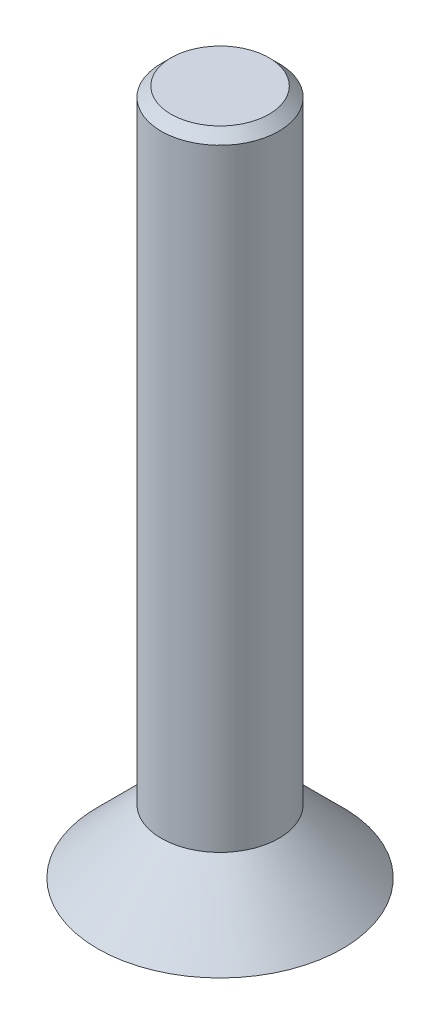
ISO-10303-21;
HEADER;
FILE_DESCRIPTION(('STEP AP214'),'2;1');
FILE_NAME('part.step','',(''),(''),'','','');
FILE_SCHEMA(('AUTOMOTIVE_DESIGN { 1 0 10303 214 1 1 1 1 }'));
ENDSEC;
DATA;
#1=APPLICATION_CONTEXT('core data for automotive mechanical design processes');
#2=APPLICATION_PROTOCOL_DEFINITION('international standard','automotive_design',2000,#1);
#3=PRODUCT_CONTEXT('',#1,'mechanical');
#4=PRODUCT('Part','Part','',(#3));
#5=PRODUCT_RELATED_PRODUCT_CATEGORY('part','',(#4));
#6=PRODUCT_DEFINITION_FORMATION('','',#4);
#7=PRODUCT_DEFINITION_CONTEXT('part definition',#1,'design');
#8=PRODUCT_DEFINITION('design','',#6,#7);
#9=PRODUCT_DEFINITION_SHAPE('','',#8);
#10=(LENGTH_UNIT() NAMED_UNIT(*) SI_UNIT(.MILLI.,.METRE.));
#11=(NAMED_UNIT(*) PLANE_ANGLE_UNIT() SI_UNIT($,.RADIAN.));
#12=(NAMED_UNIT(*) SI_UNIT($,.STERADIAN.) SOLID_ANGLE_UNIT());
#13=UNCERTAINTY_MEASURE_WITH_UNIT(LENGTH_MEASURE(1.E-05),#10,'distance_accuracy_value','');
#14=(GEOMETRIC_REPRESENTATION_CONTEXT(3) GLOBAL_UNCERTAINTY_ASSIGNED_CONTEXT((#13)) GLOBAL_UNIT_ASSIGNED_CONTEXT((#10,
#11,#12)) REPRESENTATION_CONTEXT('',''));
#15=CARTESIAN_POINT('',(0.,0.,0.));
#16=DIRECTION('',(0.,0.,1.));
#17=DIRECTION('',(1.,0.,0.));
#18=AXIS2_PLACEMENT_3D('',#15,#16,#17);
#19=CARTESIAN_POINT('',(0.,0.,0.));
#20=DIRECTION('',(0.,1.,0.));
#21=DIRECTION('',(0.,0.,1.));
#22=AXIS2_PLACEMENT_3D('',#19,#20,#21);
#23=PLANE('',#22);
#24=CARTESIAN_POINT('',(0.,0.,0.));
#25=DIRECTION('',(0.,1.,0.));
#26=DIRECTION('',(0.,0.,1.));
#27=AXIS2_PLACEMENT_3D('',#24,#25,#26);
#28=CIRCLE('',#27,2.5);
#29=CARTESIAN_POINT('',(0.,0.,2.5));
#30=VERTEX_POINT('',#29);
#31=EDGE_CURVE('E128',#30,#30,#28,.T.);
#32=ORIENTED_EDGE('',*,*,#31,.F.);
#33=EDGE_LOOP('',(#32));
#34=FACE_BOUND('',#33,.T.);
#35=DIRECTION('',(0.866025403784439,0.,0.5));
#36=VECTOR('',#35,1.);
#37=CARTESIAN_POINT('',(-0.75,0.,0.433012701892219));
#38=LINE('',#37,#36);
#39=CARTESIAN_POINT('',(-0.75,0.,0.433012701892219));
#40=VERTEX_POINT('',#39);
#41=CARTESIAN_POINT('',(0.,0.,0.866025403784438));
#42=VERTEX_POINT('',#41);
#43=EDGE_CURVE('E57',#40,#42,#38,.T.);
#44=ORIENTED_EDGE('',*,*,#43,.T.);
#45=DIRECTION('',(0.866025403784439,0.,-0.5));
#46=VECTOR('',#45,1.);
#47=CARTESIAN_POINT('',(0.,0.,0.866025403784438));
#48=LINE('',#47,#46);
#49=CARTESIAN_POINT('',(0.75,0.,0.43301270189222));
#50=VERTEX_POINT('',#49);
#51=EDGE_CURVE('E113',#42,#50,#48,.T.);
#52=ORIENTED_EDGE('',*,*,#51,.T.);
#53=DIRECTION('',(0.,0.,-1.));
#54=VECTOR('',#53,1.);
#55=CARTESIAN_POINT('',(0.75,0.,0.43301270189222));
#56=LINE('',#55,#54);
#57=CARTESIAN_POINT('',(0.75,0.,-0.43301270189222));
#58=VERTEX_POINT('',#57);
#59=EDGE_CURVE('E111',#50,#58,#56,.T.);
#60=ORIENTED_EDGE('',*,*,#59,.T.);
#61=DIRECTION('',(-0.866025403784439,0.,-0.5));
#62=VECTOR('',#61,1.);
#63=CARTESIAN_POINT('',(0.75,0.,-0.43301270189222));
#64=LINE('',#63,#62);
#65=CARTESIAN_POINT('',(0.,0.,-0.866025403784439));
#66=VERTEX_POINT('',#65);
#67=EDGE_CURVE('E92',#58,#66,#64,.T.);
#68=ORIENTED_EDGE('',*,*,#67,.T.);
#69=DIRECTION('',(-0.866025403784439,0.,0.5));
#70=VECTOR('',#69,1.);
#71=CARTESIAN_POINT('',(0.,0.,-0.866025403784439));
#72=LINE('',#71,#70);
#73=CARTESIAN_POINT('',(-0.75,0.,-0.43301270189222));
#74=VERTEX_POINT('',#73);
#75=EDGE_CURVE('E101',#66,#74,#72,.T.);
#76=ORIENTED_EDGE('',*,*,#75,.T.);
#77=DIRECTION('',(0.,0.,1.));
#78=VECTOR('',#77,1.);
#79=CARTESIAN_POINT('',(-0.75,0.,-0.43301270189222));
#80=LINE('',#79,#78);
#81=EDGE_CURVE('E107',#74,#40,#80,.T.);
#82=ORIENTED_EDGE('',*,*,#81,.T.);
#83=EDGE_LOOP('',(#44,#52,#60,#68,#76,#82));
#84=FACE_BOUND('',#83,.T.);
#85=ADVANCED_FACE('F41',(#34,#84),#23,.F.);
#86=CARTESIAN_POINT('',(-0.75,1.3,0.433012701892219));
#87=DIRECTION('',(0.5,0.,-0.866025403784439));
#88=DIRECTION('',(-0.866025403784439,0.,-0.5));
#89=AXIS2_PLACEMENT_3D('',#86,#87,#88);
#90=PLANE('',#89);
#91=ORIENTED_EDGE('',*,*,#43,.F.);
#92=DIRECTION('',(0.,-1.,0.));
#93=VECTOR('',#92,1.);
#94=CARTESIAN_POINT('',(-0.75,1.3,0.433012701892219));
#95=LINE('',#94,#93);
#96=CARTESIAN_POINT('',(-0.75,1.3,0.433012701892219));
#97=VERTEX_POINT('',#96);
#98=EDGE_CURVE('E119',#97,#40,#95,.T.);
#99=ORIENTED_EDGE('',*,*,#98,.F.);
#100=DIRECTION('',(0.866025403784439,0.,0.5));
#101=VECTOR('',#100,1.);
#102=CARTESIAN_POINT('',(-0.75,1.3,0.433012701892219));
#103=LINE('',#102,#101);
#104=CARTESIAN_POINT('',(0.,1.3,0.866025403784438));
#105=VERTEX_POINT('',#104);
#106=EDGE_CURVE('E118',#97,#105,#103,.T.);
#107=ORIENTED_EDGE('',*,*,#106,.T.);
#108=DIRECTION('',(0.,-1.,0.));
#109=VECTOR('',#108,1.);
#110=CARTESIAN_POINT('',(0.,1.3,0.866025403784438));
#111=LINE('',#110,#109);
#112=EDGE_CURVE('E126',#105,#42,#111,.T.);
#113=ORIENTED_EDGE('',*,*,#112,.T.);
#114=EDGE_LOOP('',(#91,#99,#107,#113));
#115=FACE_BOUND('',#114,.T.);
#116=ADVANCED_FACE('F147',(#115),#90,.T.);
#117=CARTESIAN_POINT('',(0.,1.3,0.866025403784438));
#118=DIRECTION('',(-0.5,0.,-0.866025403784439));
#119=DIRECTION('',(-0.866025403784439,0.,0.5));
#120=AXIS2_PLACEMENT_3D('',#117,#118,#119);
#121=PLANE('',#120);
#122=ORIENTED_EDGE('',*,*,#51,.F.);
#123=ORIENTED_EDGE('',*,*,#112,.F.);
#124=DIRECTION('',(0.866025403784439,0.,-0.5));
#125=VECTOR('',#124,1.);
#126=CARTESIAN_POINT('',(0.,1.3,0.866025403784438));
#127=LINE('',#126,#125);
#128=CARTESIAN_POINT('',(0.75,1.3,0.43301270189222));
#129=VERTEX_POINT('',#128);
#130=EDGE_CURVE('E206',#105,#129,#127,.T.);
#131=ORIENTED_EDGE('',*,*,#130,.T.);
#132=DIRECTION('',(0.,-1.,0.));
#133=VECTOR('',#132,1.);
#134=CARTESIAN_POINT('',(0.75,1.3,0.43301270189222));
#135=LINE('',#134,#133);
#136=EDGE_CURVE('E124',#129,#50,#135,.T.);
#137=ORIENTED_EDGE('',*,*,#136,.T.);
#138=EDGE_LOOP('',(#122,#123,#131,#137));
#139=FACE_BOUND('',#138,.T.);
#140=ADVANCED_FACE('F153',(#139),#121,.T.);
#141=CARTESIAN_POINT('',(0.75,1.3,0.43301270189222));
#142=DIRECTION('',(-1.,0.,0.));
#143=DIRECTION('',(0.,0.,1.));
#144=AXIS2_PLACEMENT_3D('',#141,#142,#143);
#145=PLANE('',#144);
#146=ORIENTED_EDGE('',*,*,#59,.F.);
#147=ORIENTED_EDGE('',*,*,#136,.F.);
#148=DIRECTION('',(0.,0.,-1.));
#149=VECTOR('',#148,1.);
#150=CARTESIAN_POINT('',(0.75,1.3,0.43301270189222));
#151=LINE('',#150,#149);
#152=CARTESIAN_POINT('',(0.75,1.3,-0.43301270189222));
#153=VERTEX_POINT('',#152);
#154=EDGE_CURVE('E204',#129,#153,#151,.T.);
#155=ORIENTED_EDGE('',*,*,#154,.T.);
#156=DIRECTION('',(0.,-1.,0.));
#157=VECTOR('',#156,1.);
#158=CARTESIAN_POINT('',(0.75,1.3,-0.43301270189222));
#159=LINE('',#158,#157);
#160=EDGE_CURVE('E97',#153,#58,#159,.T.);
#161=ORIENTED_EDGE('',*,*,#160,.T.);
#162=EDGE_LOOP('',(#146,#147,#155,#161));
#163=FACE_BOUND('',#162,.T.);
#164=ADVANCED_FACE('F185',(#163),#145,.T.);
#165=CARTESIAN_POINT('',(0.75,1.3,-0.43301270189222));
#166=DIRECTION('',(-0.5,0.,0.866025403784439));
#167=DIRECTION('',(0.866025403784439,0.,0.5));
#168=AXIS2_PLACEMENT_3D('',#165,#166,#167);
#169=PLANE('',#168);
#170=ORIENTED_EDGE('',*,*,#67,.F.);
#171=ORIENTED_EDGE('',*,*,#160,.F.);
#172=DIRECTION('',(-0.866025403784439,0.,-0.5));
#173=VECTOR('',#172,1.);
#174=CARTESIAN_POINT('',(0.75,1.3,-0.43301270189222));
#175=LINE('',#174,#173);
#176=CARTESIAN_POINT('',(0.,1.3,-0.866025403784439));
#177=VERTEX_POINT('',#176);
#178=EDGE_CURVE('E66',#153,#177,#175,.T.);
#179=ORIENTED_EDGE('',*,*,#178,.T.);
#180=DIRECTION('',(0.,-1.,0.));
#181=VECTOR('',#180,1.);
#182=CARTESIAN_POINT('',(0.,1.3,-0.866025403784439));
#183=LINE('',#182,#181);
#184=EDGE_CURVE('E87',#177,#66,#183,.T.);
#185=ORIENTED_EDGE('',*,*,#184,.T.);
#186=EDGE_LOOP('',(#170,#171,#179,#185));
#187=FACE_BOUND('',#186,.T.);
#188=ADVANCED_FACE('F89',(#187),#169,.T.);
#189=CARTESIAN_POINT('',(0.,1.3,-0.866025403784439));
#190=DIRECTION('',(0.5,0.,0.866025403784439));
#191=DIRECTION('',(0.866025403784439,0.,-0.5));
#192=AXIS2_PLACEMENT_3D('',#189,#190,#191);
#193=PLANE('',#192);
#194=ORIENTED_EDGE('',*,*,#75,.F.);
#195=ORIENTED_EDGE('',*,*,#184,.F.);
#196=DIRECTION('',(-0.866025403784439,0.,0.5));
#197=VECTOR('',#196,1.);
#198=CARTESIAN_POINT('',(0.,1.3,-0.866025403784439));
#199=LINE('',#198,#197);
#200=CARTESIAN_POINT('',(-0.75,1.3,-0.43301270189222));
#201=VERTEX_POINT('',#200);
#202=EDGE_CURVE('E201',#177,#201,#199,.T.);
#203=ORIENTED_EDGE('',*,*,#202,.T.);
#204=DIRECTION('',(0.,-1.,0.));
#205=VECTOR('',#204,1.);
#206=CARTESIAN_POINT('',(-0.75,1.3,-0.43301270189222));
#207=LINE('',#206,#205);
#208=EDGE_CURVE('E98',#201,#74,#207,.T.);
#209=ORIENTED_EDGE('',*,*,#208,.T.);
#210=EDGE_LOOP('',(#194,#195,#203,#209));
#211=FACE_BOUND('',#210,.T.);
#212=ADVANCED_FACE('F102',(#211),#193,.T.);
#213=CARTESIAN_POINT('',(-0.75,1.3,-0.43301270189222));
#214=DIRECTION('',(1.,0.,0.));
#215=DIRECTION('',(0.,0.,-1.));
#216=AXIS2_PLACEMENT_3D('',#213,#214,#215);
#217=PLANE('',#216);
#218=ORIENTED_EDGE('',*,*,#81,.F.);
#219=ORIENTED_EDGE('',*,*,#208,.F.);
#220=DIRECTION('',(0.,0.,1.));
#221=VECTOR('',#220,1.);
#222=CARTESIAN_POINT('',(-0.75,1.3,-0.43301270189222));
#223=LINE('',#222,#221);
#224=EDGE_CURVE('E121',#201,#97,#223,.T.);
#225=ORIENTED_EDGE('',*,*,#224,.T.);
#226=ORIENTED_EDGE('',*,*,#98,.T.);
#227=EDGE_LOOP('',(#218,#219,#225,#226));
#228=FACE_BOUND('',#227,.T.);
#229=ADVANCED_FACE('F163',(#228),#217,.T.);
#230=CARTESIAN_POINT('',(0.,1.3,0.));
#231=DIRECTION('',(0.,-1.,0.));
#232=DIRECTION('',(0.,0.,-1.));
#233=AXIS2_PLACEMENT_3D('',#230,#231,#232);
#234=CONICAL_SURFACE('',#233,1.2,0.785398163397446);
#235=ORIENTED_EDGE('',*,*,#31,.T.);
#236=EDGE_LOOP('',(#235));
#237=FACE_BOUND('',#236,.T.);
#238=CARTESIAN_POINT('',(0.,1.3,0.));
#239=DIRECTION('',(0.,1.,0.));
#240=DIRECTION('',(0.,0.,1.));
#241=AXIS2_PLACEMENT_3D('',#238,#239,#240);
#242=CIRCLE('',#241,1.2);
#243=CARTESIAN_POINT('',(0.,1.3,1.2));
#244=VERTEX_POINT('',#243);
#245=EDGE_CURVE('E131',#244,#244,#242,.T.);
#246=ORIENTED_EDGE('',*,*,#245,.F.);
#247=EDGE_LOOP('',(#246));
#248=FACE_BOUND('',#247,.T.);
#249=ADVANCED_FACE('F158',(#237,#248),#234,.T.);
#250=CARTESIAN_POINT('',(0.,1.3,0.));
#251=DIRECTION('',(0.,1.,0.));
#252=DIRECTION('',(0.,0.,1.));
#253=AXIS2_PLACEMENT_3D('',#250,#251,#252);
#254=PLANE('',#253);
#255=ORIENTED_EDGE('',*,*,#130,.F.);
#256=ORIENTED_EDGE('',*,*,#106,.F.);
#257=ORIENTED_EDGE('',*,*,#224,.F.);
#258=ORIENTED_EDGE('',*,*,#202,.F.);
#259=ORIENTED_EDGE('',*,*,#178,.F.);
#260=ORIENTED_EDGE('',*,*,#154,.F.);
#261=EDGE_LOOP('',(#255,#256,#257,#258,#259,#260));
#262=FACE_BOUND('',#261,.T.);
#263=ADVANCED_FACE('F162',(#262),#254,.F.);
#264=CARTESIAN_POINT('',(0.,14.,0.));
#265=DIRECTION('',(0.,-1.,0.));
#266=DIRECTION('',(0.,0.,-1.));
#267=AXIS2_PLACEMENT_3D('',#264,#265,#266);
#268=CYLINDRICAL_SURFACE('',#267,1.2);
#269=CARTESIAN_POINT('',(0.,13.8,0.));
#270=DIRECTION('',(0.,1.,0.));
#271=DIRECTION('',(0.,0.,1.));
#272=AXIS2_PLACEMENT_3D('',#269,#270,#271);
#273=CIRCLE('',#272,1.2);
#274=CARTESIAN_POINT('',(0.,13.8,1.2));
#275=VERTEX_POINT('',#274);
#276=EDGE_CURVE('E11',#275,#275,#273,.F.);
#277=ORIENTED_EDGE('',*,*,#276,.T.);
#278=EDGE_LOOP('',(#277));
#279=FACE_BOUND('',#278,.T.);
#280=ORIENTED_EDGE('',*,*,#245,.T.);
#281=EDGE_LOOP('',(#280));
#282=FACE_BOUND('',#281,.T.);
#283=ADVANCED_FACE('F143',(#279,#282),#268,.T.);
#284=CARTESIAN_POINT('',(0.,14.,0.));
#285=DIRECTION('',(0.,1.,0.));
#286=DIRECTION('',(0.,0.,1.));
#287=AXIS2_PLACEMENT_3D('',#284,#285,#286);
#288=PLANE('',#287);
#289=CARTESIAN_POINT('',(0.,14.,0.));
#290=DIRECTION('',(0.,1.,0.));
#291=DIRECTION('',(0.,0.,1.));
#292=AXIS2_PLACEMENT_3D('',#289,#290,#291);
#293=CIRCLE('',#292,1.);
#294=CARTESIAN_POINT('',(0.,14.,1.));
#295=VERTEX_POINT('',#294);
#296=EDGE_CURVE('E50',#295,#295,#293,.T.);
#297=ORIENTED_EDGE('',*,*,#296,.T.);
#298=EDGE_LOOP('',(#297));
#299=FACE_BOUND('',#298,.T.);
#300=ADVANCED_FACE('F136',(#299),#288,.T.);
#301=CARTESIAN_POINT('',(0.,14.,0.));
#302=DIRECTION('',(0.,-1.,0.));
#303=DIRECTION('',(0.,0.,-1.));
#304=AXIS2_PLACEMENT_3D('',#301,#302,#303);
#305=CONICAL_SURFACE('',#304,1.,0.785398163397445);
#306=ORIENTED_EDGE('',*,*,#276,.F.);
#307=EDGE_LOOP('',(#306));
#308=FACE_BOUND('',#307,.T.);
#309=ORIENTED_EDGE('',*,*,#296,.F.);
#310=EDGE_LOOP('',(#309));
#311=FACE_BOUND('',#310,.T.);
#312=ADVANCED_FACE('F44',(#308,#311),#305,.T.);
#313=CLOSED_SHELL('',(#85,#116,#140,#164,#188,#212,#229,#249,#263,#283,#300,#312));
#314=MANIFOLD_SOLID_BREP('B2',#313);
#315=ADVANCED_BREP_SHAPE_REPRESENTATION('',(#18,#314),#14);
#316=SHAPE_DEFINITION_REPRESENTATION(#9,#315);
ENDSEC;
END-ISO-10303-21;
